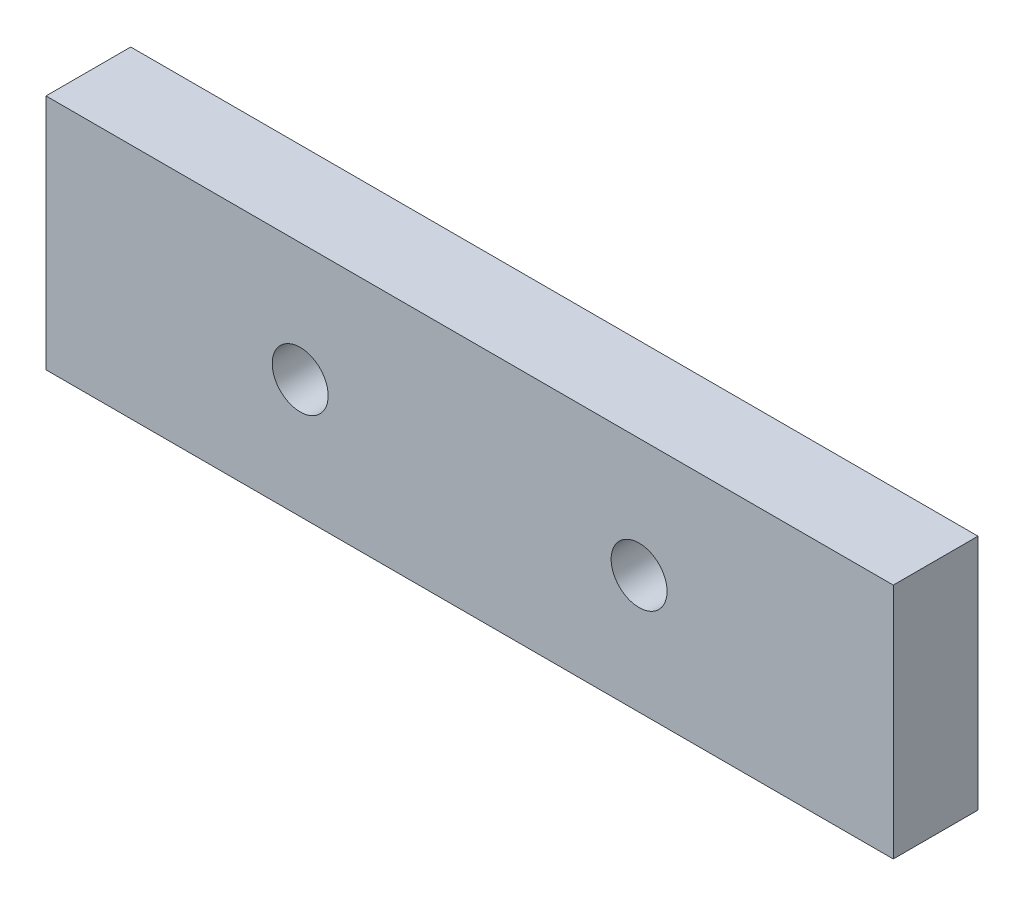
ISO-10303-21;
HEADER;
FILE_DESCRIPTION(('STEP AP214'),'2;1');
FILE_NAME('part.step','',(''),(''),'','','');
FILE_SCHEMA(('AUTOMOTIVE_DESIGN { 1 0 10303 214 1 1 1 1 }'));
ENDSEC;
DATA;
#1=APPLICATION_CONTEXT('core data for automotive mechanical design processes');
#2=APPLICATION_PROTOCOL_DEFINITION('international standard','automotive_design',2000,#1);
#3=PRODUCT_CONTEXT('',#1,'mechanical');
#4=PRODUCT('Part','Part','',(#3));
#5=PRODUCT_RELATED_PRODUCT_CATEGORY('part','',(#4));
#6=PRODUCT_DEFINITION_FORMATION('','',#4);
#7=PRODUCT_DEFINITION_CONTEXT('part definition',#1,'design');
#8=PRODUCT_DEFINITION('design','',#6,#7);
#9=PRODUCT_DEFINITION_SHAPE('','',#8);
#10=(LENGTH_UNIT() NAMED_UNIT(*) SI_UNIT(.MILLI.,.METRE.));
#11=(NAMED_UNIT(*) PLANE_ANGLE_UNIT() SI_UNIT($,.RADIAN.));
#12=(NAMED_UNIT(*) SI_UNIT($,.STERADIAN.) SOLID_ANGLE_UNIT());
#13=UNCERTAINTY_MEASURE_WITH_UNIT(LENGTH_MEASURE(1.E-05),#10,'distance_accuracy_value','');
#14=(GEOMETRIC_REPRESENTATION_CONTEXT(3) GLOBAL_UNCERTAINTY_ASSIGNED_CONTEXT((#13)) GLOBAL_UNIT_ASSIGNED_CONTEXT((#10,
#11,#12)) REPRESENTATION_CONTEXT('',''));
#15=CARTESIAN_POINT('',(0.,0.,0.));
#16=DIRECTION('',(0.,0.,1.));
#17=DIRECTION('',(1.,0.,0.));
#18=AXIS2_PLACEMENT_3D('',#15,#16,#17);
#19=CARTESIAN_POINT('',(25.,-7.,2.5));
#20=DIRECTION('',(-1.,0.,0.));
#21=DIRECTION('',(0.,0.,1.));
#22=AXIS2_PLACEMENT_3D('',#19,#20,#21);
#23=PLANE('',#22);
#24=DIRECTION('',(0.,1.,0.));
#25=VECTOR('',#24,1.);
#26=CARTESIAN_POINT('',(25.,-7.,-2.5));
#27=LINE('',#26,#25);
#28=CARTESIAN_POINT('',(25.,-7.,-2.5));
#29=VERTEX_POINT('',#28);
#30=CARTESIAN_POINT('',(25.,7.,-2.5));
#31=VERTEX_POINT('',#30);
#32=EDGE_CURVE('E100',#29,#31,#27,.T.);
#33=ORIENTED_EDGE('',*,*,#32,.T.);
#34=DIRECTION('',(0.,0.,-1.));
#35=VECTOR('',#34,1.);
#36=CARTESIAN_POINT('',(25.,7.,2.5));
#37=LINE('',#36,#35);
#38=CARTESIAN_POINT('',(25.,7.,2.5));
#39=VERTEX_POINT('',#38);
#40=EDGE_CURVE('E11',#39,#31,#37,.T.);
#41=ORIENTED_EDGE('',*,*,#40,.F.);
#42=DIRECTION('',(0.,1.,0.));
#43=VECTOR('',#42,1.);
#44=CARTESIAN_POINT('',(25.,-7.,2.5));
#45=LINE('',#44,#43);
#46=CARTESIAN_POINT('',(25.,-7.,2.5));
#47=VERTEX_POINT('',#46);
#48=EDGE_CURVE('E88',#47,#39,#45,.T.);
#49=ORIENTED_EDGE('',*,*,#48,.F.);
#50=DIRECTION('',(0.,0.,-1.));
#51=VECTOR('',#50,1.);
#52=CARTESIAN_POINT('',(25.,-7.,2.5));
#53=LINE('',#52,#51);
#54=EDGE_CURVE('E96',#47,#29,#53,.T.);
#55=ORIENTED_EDGE('',*,*,#54,.T.);
#56=EDGE_LOOP('',(#33,#41,#49,#55));
#57=FACE_BOUND('',#56,.T.);
#58=ADVANCED_FACE('F37',(#57),#23,.F.);
#59=CARTESIAN_POINT('',(-25.,7.,2.5));
#60=DIRECTION('',(0.,-1.,0.));
#61=DIRECTION('',(0.,0.,-1.));
#62=AXIS2_PLACEMENT_3D('',#59,#60,#61);
#63=PLANE('',#62);
#64=DIRECTION('',(-1.,0.,0.));
#65=VECTOR('',#64,1.);
#66=CARTESIAN_POINT('',(-25.,7.,-2.5));
#67=LINE('',#66,#65);
#68=CARTESIAN_POINT('',(-25.,7.,-2.5));
#69=VERTEX_POINT('',#68);
#70=EDGE_CURVE('E92',#31,#69,#67,.T.);
#71=ORIENTED_EDGE('',*,*,#70,.T.);
#72=DIRECTION('',(0.,0.,-1.));
#73=VECTOR('',#72,1.);
#74=CARTESIAN_POINT('',(-25.,7.,2.5));
#75=LINE('',#74,#73);
#76=CARTESIAN_POINT('',(-25.,7.,2.5));
#77=VERTEX_POINT('',#76);
#78=EDGE_CURVE('E45',#77,#69,#75,.T.);
#79=ORIENTED_EDGE('',*,*,#78,.F.);
#80=DIRECTION('',(-1.,0.,0.));
#81=VECTOR('',#80,1.);
#82=CARTESIAN_POINT('',(-25.,7.,2.5));
#83=LINE('',#82,#81);
#84=EDGE_CURVE('E83',#39,#77,#83,.T.);
#85=ORIENTED_EDGE('',*,*,#84,.F.);
#86=ORIENTED_EDGE('',*,*,#40,.T.);
#87=EDGE_LOOP('',(#71,#79,#85,#86));
#88=FACE_BOUND('',#87,.T.);
#89=ADVANCED_FACE('F91',(#88),#63,.F.);
#90=CARTESIAN_POINT('',(-25.,-7.,2.5));
#91=DIRECTION('',(1.,0.,0.));
#92=DIRECTION('',(0.,0.,-1.));
#93=AXIS2_PLACEMENT_3D('',#90,#91,#92);
#94=PLANE('',#93);
#95=DIRECTION('',(0.,-1.,0.));
#96=VECTOR('',#95,1.);
#97=CARTESIAN_POINT('',(-25.,-7.,-2.5));
#98=LINE('',#97,#96);
#99=CARTESIAN_POINT('',(-25.,-7.,-2.5));
#100=VERTEX_POINT('',#99);
#101=EDGE_CURVE('E70',#69,#100,#98,.T.);
#102=ORIENTED_EDGE('',*,*,#101,.T.);
#103=DIRECTION('',(0.,0.,-1.));
#104=VECTOR('',#103,1.);
#105=CARTESIAN_POINT('',(-25.,-7.,2.5));
#106=LINE('',#105,#104);
#107=CARTESIAN_POINT('',(-25.,-7.,2.5));
#108=VERTEX_POINT('',#107);
#109=EDGE_CURVE('E93',#108,#100,#106,.T.);
#110=ORIENTED_EDGE('',*,*,#109,.F.);
#111=DIRECTION('',(0.,-1.,0.));
#112=VECTOR('',#111,1.);
#113=CARTESIAN_POINT('',(-25.,-7.,2.5));
#114=LINE('',#113,#112);
#115=EDGE_CURVE('E86',#77,#108,#114,.T.);
#116=ORIENTED_EDGE('',*,*,#115,.F.);
#117=ORIENTED_EDGE('',*,*,#78,.T.);
#118=EDGE_LOOP('',(#102,#110,#116,#117));
#119=FACE_BOUND('',#118,.T.);
#120=ADVANCED_FACE('F94',(#119),#94,.F.);
#121=CARTESIAN_POINT('',(-25.,-7.,2.5));
#122=DIRECTION('',(0.,1.,0.));
#123=DIRECTION('',(0.,0.,1.));
#124=AXIS2_PLACEMENT_3D('',#121,#122,#123);
#125=PLANE('',#124);
#126=DIRECTION('',(1.,0.,0.));
#127=VECTOR('',#126,1.);
#128=CARTESIAN_POINT('',(-25.,-7.,-2.5));
#129=LINE('',#128,#127);
#130=EDGE_CURVE('E76',#100,#29,#129,.T.);
#131=ORIENTED_EDGE('',*,*,#130,.T.);
#132=ORIENTED_EDGE('',*,*,#54,.F.);
#133=DIRECTION('',(1.,0.,0.));
#134=VECTOR('',#133,1.);
#135=CARTESIAN_POINT('',(-25.,-7.,2.5));
#136=LINE('',#135,#134);
#137=EDGE_CURVE('E53',#108,#47,#136,.T.);
#138=ORIENTED_EDGE('',*,*,#137,.F.);
#139=ORIENTED_EDGE('',*,*,#109,.T.);
#140=EDGE_LOOP('',(#131,#132,#138,#139));
#141=FACE_BOUND('',#140,.T.);
#142=ADVANCED_FACE('F108',(#141),#125,.F.);
#143=CARTESIAN_POINT('',(0.,0.,2.5));
#144=DIRECTION('',(0.,0.,-1.));
#145=DIRECTION('',(-1.,0.,0.));
#146=AXIS2_PLACEMENT_3D('',#143,#144,#145);
#147=PLANE('',#146);
#148=CARTESIAN_POINT('',(-10.,0.,2.5));
#149=DIRECTION('',(0.,0.,1.));
#150=DIRECTION('',(1.,0.,0.));
#151=AXIS2_PLACEMENT_3D('',#148,#149,#150);
#152=CIRCLE('',#151,1.64999999999999);
#153=CARTESIAN_POINT('',(-8.35000000000002,0.,2.5));
#154=VERTEX_POINT('',#153);
#155=EDGE_CURVE('E122',#154,#154,#152,.T.);
#156=ORIENTED_EDGE('',*,*,#155,.F.);
#157=EDGE_LOOP('',(#156));
#158=FACE_BOUND('',#157,.T.);
#159=CARTESIAN_POINT('',(9.99999999999999,0.,2.5));
#160=DIRECTION('',(0.,0.,1.));
#161=DIRECTION('',(1.,0.,0.));
#162=AXIS2_PLACEMENT_3D('',#159,#160,#161);
#163=CIRCLE('',#162,1.64999999999999);
#164=CARTESIAN_POINT('',(11.65,0.,2.5));
#165=VERTEX_POINT('',#164);
#166=EDGE_CURVE('E116',#165,#165,#163,.T.);
#167=ORIENTED_EDGE('',*,*,#166,.F.);
#168=EDGE_LOOP('',(#167));
#169=FACE_BOUND('',#168,.T.);
#170=ORIENTED_EDGE('',*,*,#48,.T.);
#171=ORIENTED_EDGE('',*,*,#84,.T.);
#172=ORIENTED_EDGE('',*,*,#115,.T.);
#173=ORIENTED_EDGE('',*,*,#137,.T.);
#174=EDGE_LOOP('',(#170,#171,#172,#173));
#175=FACE_BOUND('',#174,.T.);
#176=ADVANCED_FACE('F84',(#158,#169,#175),#147,.F.);
#177=CARTESIAN_POINT('',(0.,0.,-2.5));
#178=DIRECTION('',(0.,0.,-1.));
#179=DIRECTION('',(-1.,0.,0.));
#180=AXIS2_PLACEMENT_3D('',#177,#178,#179);
#181=PLANE('',#180);
#182=CARTESIAN_POINT('',(-10.,0.,-2.5));
#183=DIRECTION('',(0.,0.,1.));
#184=DIRECTION('',(1.,0.,0.));
#185=AXIS2_PLACEMENT_3D('',#182,#183,#184);
#186=CIRCLE('',#185,1.65);
#187=CARTESIAN_POINT('',(-8.35000000000001,0.,-2.5));
#188=VERTEX_POINT('',#187);
#189=EDGE_CURVE('E119',#188,#188,#186,.T.);
#190=ORIENTED_EDGE('',*,*,#189,.T.);
#191=EDGE_LOOP('',(#190));
#192=FACE_BOUND('',#191,.T.);
#193=CARTESIAN_POINT('',(9.99999999999999,0.,-2.5));
#194=DIRECTION('',(0.,0.,1.));
#195=DIRECTION('',(1.,0.,0.));
#196=AXIS2_PLACEMENT_3D('',#193,#194,#195);
#197=CIRCLE('',#196,1.65);
#198=CARTESIAN_POINT('',(11.65,0.,-2.5));
#199=VERTEX_POINT('',#198);
#200=EDGE_CURVE('E103',#199,#199,#197,.T.);
#201=ORIENTED_EDGE('',*,*,#200,.T.);
#202=EDGE_LOOP('',(#201));
#203=FACE_BOUND('',#202,.T.);
#204=ORIENTED_EDGE('',*,*,#32,.F.);
#205=ORIENTED_EDGE('',*,*,#130,.F.);
#206=ORIENTED_EDGE('',*,*,#101,.F.);
#207=ORIENTED_EDGE('',*,*,#70,.F.);
#208=EDGE_LOOP('',(#204,#205,#206,#207));
#209=FACE_BOUND('',#208,.T.);
#210=ADVANCED_FACE('F111',(#192,#203,#209),#181,.T.);
#211=CARTESIAN_POINT('',(9.99999999999999,0.,2.5));
#212=DIRECTION('',(0.,0.,1.));
#213=DIRECTION('',(1.,0.,0.));
#214=AXIS2_PLACEMENT_3D('',#211,#212,#213);
#215=CYLINDRICAL_SURFACE('',#214,1.64999999999999);
#216=ORIENTED_EDGE('',*,*,#200,.F.);
#217=EDGE_LOOP('',(#216));
#218=FACE_BOUND('',#217,.T.);
#219=ORIENTED_EDGE('',*,*,#166,.T.);
#220=EDGE_LOOP('',(#219));
#221=FACE_BOUND('',#220,.T.);
#222=ADVANCED_FACE('F133',(#218,#221),#215,.F.);
#223=CARTESIAN_POINT('',(-10.,0.,2.5));
#224=DIRECTION('',(0.,0.,1.));
#225=DIRECTION('',(1.,0.,0.));
#226=AXIS2_PLACEMENT_3D('',#223,#224,#225);
#227=CYLINDRICAL_SURFACE('',#226,1.64999999999999);
#228=ORIENTED_EDGE('',*,*,#189,.F.);
#229=EDGE_LOOP('',(#228));
#230=FACE_BOUND('',#229,.T.);
#231=ORIENTED_EDGE('',*,*,#155,.T.);
#232=EDGE_LOOP('',(#231));
#233=FACE_BOUND('',#232,.T.);
#234=ADVANCED_FACE('F126',(#230,#233),#227,.F.);
#235=CLOSED_SHELL('',(#58,#89,#120,#142,#176,#210,#222,#234));
#236=MANIFOLD_SOLID_BREP('B2',#235);
#237=ADVANCED_BREP_SHAPE_REPRESENTATION('',(#18,#236),#14);
#238=SHAPE_DEFINITION_REPRESENTATION(#9,#237);
ENDSEC;
END-ISO-10303-21;
